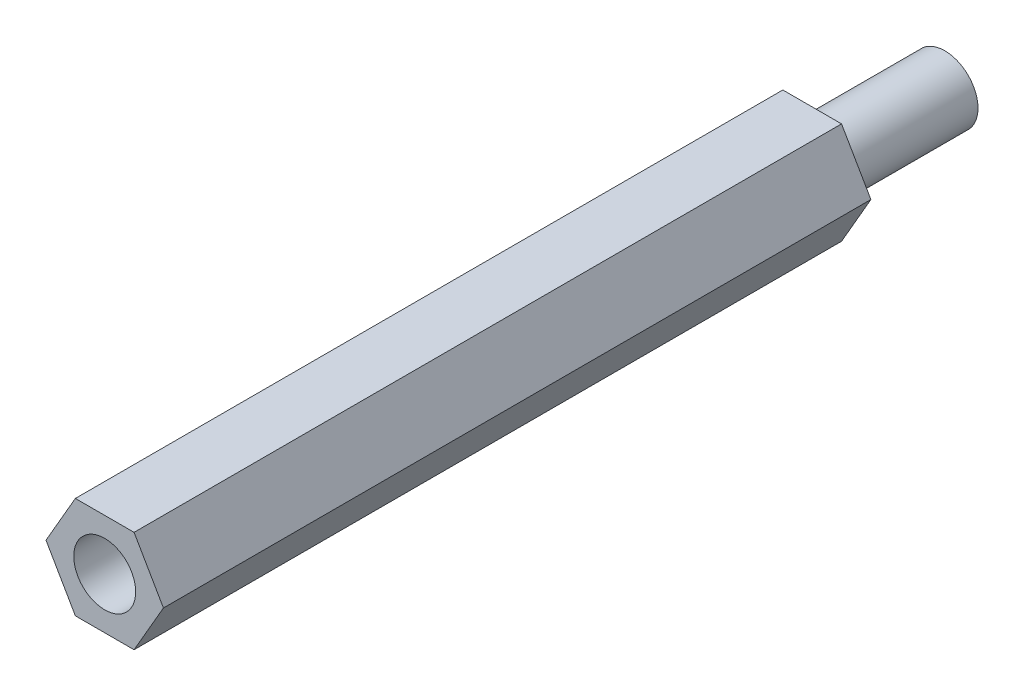
ISO-10303-21;
HEADER;
FILE_DESCRIPTION(('STEP AP214'),'2;1');
FILE_NAME('part.step','',(''),(''),'','','');
FILE_SCHEMA(('AUTOMOTIVE_DESIGN { 1 0 10303 214 1 1 1 1 }'));
ENDSEC;
DATA;
#1=APPLICATION_CONTEXT('core data for automotive mechanical design processes');
#2=APPLICATION_PROTOCOL_DEFINITION('international standard','automotive_design',2000,#1);
#3=PRODUCT_CONTEXT('',#1,'mechanical');
#4=PRODUCT('Part','Part','',(#3));
#5=PRODUCT_RELATED_PRODUCT_CATEGORY('part','',(#4));
#6=PRODUCT_DEFINITION_FORMATION('','',#4);
#7=PRODUCT_DEFINITION_CONTEXT('part definition',#1,'design');
#8=PRODUCT_DEFINITION('design','',#6,#7);
#9=PRODUCT_DEFINITION_SHAPE('','',#8);
#10=(LENGTH_UNIT() NAMED_UNIT(*) SI_UNIT(.MILLI.,.METRE.));
#11=(NAMED_UNIT(*) PLANE_ANGLE_UNIT() SI_UNIT($,.RADIAN.));
#12=(NAMED_UNIT(*) SI_UNIT($,.STERADIAN.) SOLID_ANGLE_UNIT());
#13=UNCERTAINTY_MEASURE_WITH_UNIT(LENGTH_MEASURE(1.E-05),#10,'distance_accuracy_value','');
#14=(GEOMETRIC_REPRESENTATION_CONTEXT(3) GLOBAL_UNCERTAINTY_ASSIGNED_CONTEXT((#13)) GLOBAL_UNIT_ASSIGNED_CONTEXT((#10,
#11,#12)) REPRESENTATION_CONTEXT('',''));
#15=CARTESIAN_POINT('',(0.,0.,0.));
#16=DIRECTION('',(0.,0.,1.));
#17=DIRECTION('',(1.,0.,0.));
#18=AXIS2_PLACEMENT_3D('',#15,#16,#17);
#19=CARTESIAN_POINT('',(0.,0.,32.));
#20=DIRECTION('',(0.,0.,1.));
#21=DIRECTION('',(1.,0.,0.));
#22=AXIS2_PLACEMENT_3D('',#19,#20,#21);
#23=PLANE('',#22);
#24=DIRECTION('',(0.5,0.866025403784439,0.));
#25=VECTOR('',#24,1.);
#26=CARTESIAN_POINT('',(1.32790561913614,-2.3,32.));
#27=LINE('',#26,#25);
#28=CARTESIAN_POINT('',(1.32790561913614,-2.3,32.));
#29=VERTEX_POINT('',#28);
#30=CARTESIAN_POINT('',(2.65581123827228,0.,32.));
#31=VERTEX_POINT('',#30);
#32=EDGE_CURVE('E132',#29,#31,#27,.T.);
#33=ORIENTED_EDGE('',*,*,#32,.T.);
#34=DIRECTION('',(-0.5,0.866025403784439,0.));
#35=VECTOR('',#34,1.);
#36=CARTESIAN_POINT('',(2.65581123827228,0.,32.));
#37=LINE('',#36,#35);
#38=CARTESIAN_POINT('',(1.32790561913614,2.3,32.));
#39=VERTEX_POINT('',#38);
#40=EDGE_CURVE('E90',#31,#39,#37,.T.);
#41=ORIENTED_EDGE('',*,*,#40,.T.);
#42=DIRECTION('',(-1.,0.,0.));
#43=VECTOR('',#42,1.);
#44=CARTESIAN_POINT('',(1.32790561913614,2.3,32.));
#45=LINE('',#44,#43);
#46=CARTESIAN_POINT('',(-1.32790561913614,2.3,32.));
#47=VERTEX_POINT('',#46);
#48=EDGE_CURVE('E103',#39,#47,#45,.T.);
#49=ORIENTED_EDGE('',*,*,#48,.T.);
#50=DIRECTION('',(-0.5,-0.866025403784439,0.));
#51=VECTOR('',#50,1.);
#52=CARTESIAN_POINT('',(-1.32790561913614,2.3,32.));
#53=LINE('',#52,#51);
#54=CARTESIAN_POINT('',(-2.65581123827228,0.,32.));
#55=VERTEX_POINT('',#54);
#56=EDGE_CURVE('E97',#47,#55,#53,.T.);
#57=ORIENTED_EDGE('',*,*,#56,.T.);
#58=DIRECTION('',(0.5,-0.866025403784439,0.));
#59=VECTOR('',#58,1.);
#60=CARTESIAN_POINT('',(-2.65581123827228,0.,32.));
#61=LINE('',#60,#59);
#62=CARTESIAN_POINT('',(-1.32790561913614,-2.3,32.));
#63=VERTEX_POINT('',#62);
#64=EDGE_CURVE('E101',#55,#63,#61,.T.);
#65=ORIENTED_EDGE('',*,*,#64,.T.);
#66=DIRECTION('',(1.,0.,0.));
#67=VECTOR('',#66,1.);
#68=CARTESIAN_POINT('',(-1.32790561913614,-2.3,32.));
#69=LINE('',#68,#67);
#70=EDGE_CURVE('E52',#63,#29,#69,.T.);
#71=ORIENTED_EDGE('',*,*,#70,.T.);
#72=EDGE_LOOP('',(#33,#41,#49,#57,#65,#71));
#73=FACE_BOUND('',#72,.T.);
#74=CARTESIAN_POINT('',(0.,0.,32.));
#75=DIRECTION('',(0.,0.,1.));
#76=DIRECTION('',(1.,0.,0.));
#77=AXIS2_PLACEMENT_3D('',#74,#75,#76);
#78=CIRCLE('',#77,1.4);
#79=CARTESIAN_POINT('',(1.4,0.,32.));
#80=VERTEX_POINT('',#79);
#81=EDGE_CURVE('E125',#80,#80,#78,.T.);
#82=ORIENTED_EDGE('',*,*,#81,.F.);
#83=EDGE_LOOP('',(#82));
#84=FACE_BOUND('',#83,.T.);
#85=ADVANCED_FACE('F35',(#73,#84),#23,.T.);
#86=CARTESIAN_POINT('',(0.,0.,0.));
#87=DIRECTION('',(0.,0.,1.));
#88=DIRECTION('',(1.,0.,0.));
#89=AXIS2_PLACEMENT_3D('',#86,#87,#88);
#90=PLANE('',#89);
#91=CARTESIAN_POINT('',(0.,0.,0.));
#92=DIRECTION('',(0.,0.,1.));
#93=DIRECTION('',(1.,0.,0.));
#94=AXIS2_PLACEMENT_3D('',#91,#92,#93);
#95=CIRCLE('',#94,1.5);
#96=CARTESIAN_POINT('',(1.5,0.,0.));
#97=VERTEX_POINT('',#96);
#98=EDGE_CURVE('E11',#97,#97,#95,.F.);
#99=ORIENTED_EDGE('',*,*,#98,.F.);
#100=EDGE_LOOP('',(#99));
#101=FACE_BOUND('',#100,.T.);
#102=DIRECTION('',(0.5,0.866025403784439,0.));
#103=VECTOR('',#102,1.);
#104=CARTESIAN_POINT('',(1.32790561913614,-2.3,0.));
#105=LINE('',#104,#103);
#106=CARTESIAN_POINT('',(1.32790561913614,-2.3,0.));
#107=VERTEX_POINT('',#106);
#108=CARTESIAN_POINT('',(2.65581123827228,0.,0.));
#109=VERTEX_POINT('',#108);
#110=EDGE_CURVE('E121',#107,#109,#105,.T.);
#111=ORIENTED_EDGE('',*,*,#110,.F.);
#112=DIRECTION('',(1.,0.,0.));
#113=VECTOR('',#112,1.);
#114=CARTESIAN_POINT('',(-1.32790561913614,-2.3,0.));
#115=LINE('',#114,#113);
#116=CARTESIAN_POINT('',(-1.32790561913614,-2.3,0.));
#117=VERTEX_POINT('',#116);
#118=EDGE_CURVE('E81',#117,#107,#115,.T.);
#119=ORIENTED_EDGE('',*,*,#118,.F.);
#120=DIRECTION('',(0.5,-0.866025403784439,0.));
#121=VECTOR('',#120,1.);
#122=CARTESIAN_POINT('',(-2.65581123827228,0.,0.));
#123=LINE('',#122,#121);
#124=CARTESIAN_POINT('',(-2.65581123827228,0.,0.));
#125=VERTEX_POINT('',#124);
#126=EDGE_CURVE('E75',#125,#117,#123,.T.);
#127=ORIENTED_EDGE('',*,*,#126,.F.);
#128=DIRECTION('',(-0.5,-0.866025403784439,0.));
#129=VECTOR('',#128,1.);
#130=CARTESIAN_POINT('',(-1.32790561913614,2.3,0.));
#131=LINE('',#130,#129);
#132=CARTESIAN_POINT('',(-1.32790561913614,2.3,0.));
#133=VERTEX_POINT('',#132);
#134=EDGE_CURVE('E111',#133,#125,#131,.T.);
#135=ORIENTED_EDGE('',*,*,#134,.F.);
#136=DIRECTION('',(-1.,0.,0.));
#137=VECTOR('',#136,1.);
#138=CARTESIAN_POINT('',(1.32790561913614,2.3,0.));
#139=LINE('',#138,#137);
#140=CARTESIAN_POINT('',(1.32790561913614,2.3,0.));
#141=VERTEX_POINT('',#140);
#142=EDGE_CURVE('E127',#141,#133,#139,.T.);
#143=ORIENTED_EDGE('',*,*,#142,.F.);
#144=DIRECTION('',(-0.5,0.866025403784439,0.));
#145=VECTOR('',#144,1.);
#146=CARTESIAN_POINT('',(2.65581123827228,0.,0.));
#147=LINE('',#146,#145);
#148=EDGE_CURVE('E124',#109,#141,#147,.T.);
#149=ORIENTED_EDGE('',*,*,#148,.F.);
#150=EDGE_LOOP('',(#111,#119,#127,#135,#143,#149));
#151=FACE_BOUND('',#150,.T.);
#152=ADVANCED_FACE('F144',(#101,#151),#90,.F.);
#153=CARTESIAN_POINT('',(1.32790561913614,-2.3,32.));
#154=DIRECTION('',(-0.866025403784439,0.5,0.));
#155=DIRECTION('',(-0.5,-0.866025403784439,0.));
#156=AXIS2_PLACEMENT_3D('',#153,#154,#155);
#157=PLANE('',#156);
#158=ORIENTED_EDGE('',*,*,#110,.T.);
#159=DIRECTION('',(0.,0.,-1.));
#160=VECTOR('',#159,1.);
#161=CARTESIAN_POINT('',(2.65581123827228,0.,32.));
#162=LINE('',#161,#160);
#163=EDGE_CURVE('E44',#31,#109,#162,.T.);
#164=ORIENTED_EDGE('',*,*,#163,.F.);
#165=ORIENTED_EDGE('',*,*,#32,.F.);
#166=DIRECTION('',(0.,0.,-1.));
#167=VECTOR('',#166,1.);
#168=CARTESIAN_POINT('',(1.32790561913614,-2.3,32.));
#169=LINE('',#168,#167);
#170=EDGE_CURVE('E117',#29,#107,#169,.T.);
#171=ORIENTED_EDGE('',*,*,#170,.T.);
#172=EDGE_LOOP('',(#158,#164,#165,#171));
#173=FACE_BOUND('',#172,.T.);
#174=ADVANCED_FACE('F37',(#173),#157,.F.);
#175=CARTESIAN_POINT('',(2.65581123827228,0.,32.));
#176=DIRECTION('',(-0.866025403784439,-0.5,0.));
#177=DIRECTION('',(0.5,-0.866025403784439,0.));
#178=AXIS2_PLACEMENT_3D('',#175,#176,#177);
#179=PLANE('',#178);
#180=ORIENTED_EDGE('',*,*,#148,.T.);
#181=DIRECTION('',(0.,0.,-1.));
#182=VECTOR('',#181,1.);
#183=CARTESIAN_POINT('',(1.32790561913614,2.3,32.));
#184=LINE('',#183,#182);
#185=EDGE_CURVE('E136',#39,#141,#184,.T.);
#186=ORIENTED_EDGE('',*,*,#185,.F.);
#187=ORIENTED_EDGE('',*,*,#40,.F.);
#188=ORIENTED_EDGE('',*,*,#163,.T.);
#189=EDGE_LOOP('',(#180,#186,#187,#188));
#190=FACE_BOUND('',#189,.T.);
#191=ADVANCED_FACE('F139',(#190),#179,.F.);
#192=CARTESIAN_POINT('',(1.32790561913614,2.3,32.));
#193=DIRECTION('',(0.,-1.,0.));
#194=DIRECTION('',(1.,0.,0.));
#195=AXIS2_PLACEMENT_3D('',#192,#193,#194);
#196=PLANE('',#195);
#197=ORIENTED_EDGE('',*,*,#142,.T.);
#198=DIRECTION('',(0.,0.,-1.));
#199=VECTOR('',#198,1.);
#200=CARTESIAN_POINT('',(-1.32790561913614,2.3,32.));
#201=LINE('',#200,#199);
#202=EDGE_CURVE('E112',#47,#133,#201,.T.);
#203=ORIENTED_EDGE('',*,*,#202,.F.);
#204=ORIENTED_EDGE('',*,*,#48,.F.);
#205=ORIENTED_EDGE('',*,*,#185,.T.);
#206=EDGE_LOOP('',(#197,#203,#204,#205));
#207=FACE_BOUND('',#206,.T.);
#208=ADVANCED_FACE('F147',(#207),#196,.F.);
#209=CARTESIAN_POINT('',(-1.32790561913614,2.3,32.));
#210=DIRECTION('',(0.866025403784439,-0.5,0.));
#211=DIRECTION('',(0.5,0.866025403784439,0.));
#212=AXIS2_PLACEMENT_3D('',#209,#210,#211);
#213=PLANE('',#212);
#214=ORIENTED_EDGE('',*,*,#134,.T.);
#215=DIRECTION('',(0.,0.,-1.));
#216=VECTOR('',#215,1.);
#217=CARTESIAN_POINT('',(-2.65581123827228,0.,32.));
#218=LINE('',#217,#216);
#219=EDGE_CURVE('E108',#55,#125,#218,.T.);
#220=ORIENTED_EDGE('',*,*,#219,.F.);
#221=ORIENTED_EDGE('',*,*,#56,.F.);
#222=ORIENTED_EDGE('',*,*,#202,.T.);
#223=EDGE_LOOP('',(#214,#220,#221,#222));
#224=FACE_BOUND('',#223,.T.);
#225=ADVANCED_FACE('F109',(#224),#213,.F.);
#226=CARTESIAN_POINT('',(-2.65581123827228,0.,32.));
#227=DIRECTION('',(0.866025403784439,0.5,0.));
#228=DIRECTION('',(-0.5,0.866025403784439,0.));
#229=AXIS2_PLACEMENT_3D('',#226,#227,#228);
#230=PLANE('',#229);
#231=ORIENTED_EDGE('',*,*,#126,.T.);
#232=DIRECTION('',(0.,0.,-1.));
#233=VECTOR('',#232,1.);
#234=CARTESIAN_POINT('',(-1.32790561913614,-2.3,32.));
#235=LINE('',#234,#233);
#236=EDGE_CURVE('E113',#63,#117,#235,.T.);
#237=ORIENTED_EDGE('',*,*,#236,.F.);
#238=ORIENTED_EDGE('',*,*,#64,.F.);
#239=ORIENTED_EDGE('',*,*,#219,.T.);
#240=EDGE_LOOP('',(#231,#237,#238,#239));
#241=FACE_BOUND('',#240,.T.);
#242=ADVANCED_FACE('F115',(#241),#230,.F.);
#243=CARTESIAN_POINT('',(-1.32790561913614,-2.3,32.));
#244=DIRECTION('',(0.,1.,0.));
#245=DIRECTION('',(0.,0.,1.));
#246=AXIS2_PLACEMENT_3D('',#243,#244,#245);
#247=PLANE('',#246);
#248=ORIENTED_EDGE('',*,*,#118,.T.);
#249=ORIENTED_EDGE('',*,*,#170,.F.);
#250=ORIENTED_EDGE('',*,*,#70,.F.);
#251=ORIENTED_EDGE('',*,*,#236,.T.);
#252=EDGE_LOOP('',(#248,#249,#250,#251));
#253=FACE_BOUND('',#252,.T.);
#254=ADVANCED_FACE('F178',(#253),#247,.F.);
#255=CARTESIAN_POINT('',(0.,0.,32.));
#256=DIRECTION('',(0.,0.,-1.));
#257=DIRECTION('',(-1.,0.,0.));
#258=AXIS2_PLACEMENT_3D('',#255,#256,#257);
#259=CYLINDRICAL_SURFACE('',#258,1.4);
#260=ORIENTED_EDGE('',*,*,#81,.T.);
#261=EDGE_LOOP('',(#260));
#262=FACE_BOUND('',#261,.T.);
#263=CARTESIAN_POINT('',(0.,0.,0.));
#264=DIRECTION('',(0.,0.,1.));
#265=DIRECTION('',(1.,0.,0.));
#266=AXIS2_PLACEMENT_3D('',#263,#264,#265);
#267=CIRCLE('',#266,1.4);
#268=CARTESIAN_POINT('',(1.4,0.,0.));
#269=VERTEX_POINT('',#268);
#270=EDGE_CURVE('E151',#269,#269,#267,.T.);
#271=ORIENTED_EDGE('',*,*,#270,.F.);
#272=EDGE_LOOP('',(#271));
#273=FACE_BOUND('',#272,.T.);
#274=ADVANCED_FACE('F181',(#262,#273),#259,.F.);
#275=CARTESIAN_POINT('',(0.,0.,0.));
#276=DIRECTION('',(0.,0.,-1.));
#277=DIRECTION('',(-1.,0.,0.));
#278=AXIS2_PLACEMENT_3D('',#275,#276,#277);
#279=PLANE('',#278);
#280=ORIENTED_EDGE('',*,*,#270,.T.);
#281=EDGE_LOOP('',(#280));
#282=FACE_BOUND('',#281,.T.);
#283=ADVANCED_FACE('F165',(#282),#279,.F.);
#284=CARTESIAN_POINT('',(0.,0.,-6.));
#285=DIRECTION('',(0.,0.,1.));
#286=DIRECTION('',(1.,0.,0.));
#287=AXIS2_PLACEMENT_3D('',#284,#285,#286);
#288=CYLINDRICAL_SURFACE('',#287,1.5);
#289=CARTESIAN_POINT('',(0.,0.,-6.));
#290=DIRECTION('',(0.,0.,-1.));
#291=DIRECTION('',(-1.,0.,0.));
#292=AXIS2_PLACEMENT_3D('',#289,#290,#291);
#293=CIRCLE('',#292,1.5);
#294=CARTESIAN_POINT('',(-1.5,0.,-6.));
#295=VERTEX_POINT('',#294);
#296=EDGE_CURVE('E154',#295,#295,#293,.T.);
#297=ORIENTED_EDGE('',*,*,#296,.F.);
#298=EDGE_LOOP('',(#297));
#299=FACE_BOUND('',#298,.T.);
#300=ORIENTED_EDGE('',*,*,#98,.T.);
#301=EDGE_LOOP('',(#300));
#302=FACE_BOUND('',#301,.T.);
#303=ADVANCED_FACE('F162',(#299,#302),#288,.T.);
#304=CARTESIAN_POINT('',(0.,0.,-6.));
#305=DIRECTION('',(0.,0.,-1.));
#306=DIRECTION('',(-1.,0.,0.));
#307=AXIS2_PLACEMENT_3D('',#304,#305,#306);
#308=PLANE('',#307);
#309=ORIENTED_EDGE('',*,*,#296,.T.);
#310=EDGE_LOOP('',(#309));
#311=FACE_BOUND('',#310,.T.);
#312=ADVANCED_FACE('F160',(#311),#308,.T.);
#313=CLOSED_SHELL('',(#85,#152,#174,#191,#208,#225,#242,#254,#274,#283,#303,#312));
#314=MANIFOLD_SOLID_BREP('B2',#313);
#315=ADVANCED_BREP_SHAPE_REPRESENTATION('',(#18,#314),#14);
#316=SHAPE_DEFINITION_REPRESENTATION(#9,#315);
ENDSEC;
END-ISO-10303-21;
